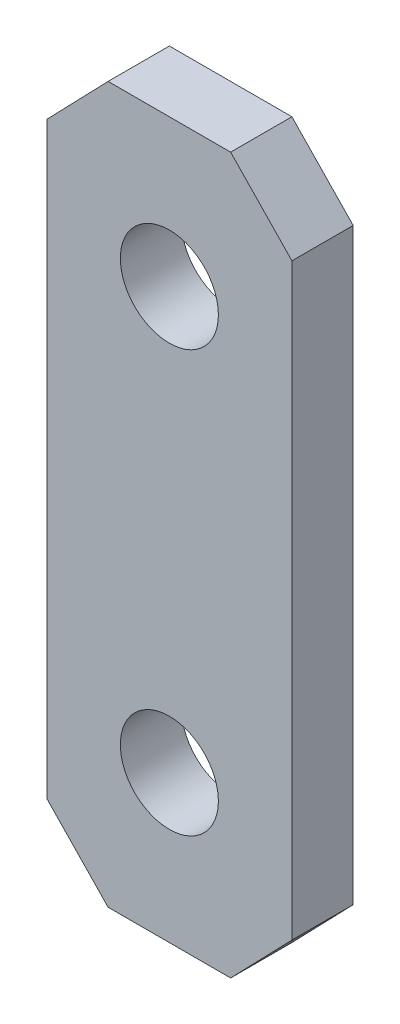
ISO-10303-21;
HEADER;
FILE_DESCRIPTION(('STEP AP214'),'2;1');
FILE_NAME('part.step','',(''),(''),'','','');
FILE_SCHEMA(('AUTOMOTIVE_DESIGN { 1 0 10303 214 1 1 1 1 }'));
ENDSEC;
DATA;
#1=APPLICATION_CONTEXT('core data for automotive mechanical design processes');
#2=APPLICATION_PROTOCOL_DEFINITION('international standard','automotive_design',2000,#1);
#3=PRODUCT_CONTEXT('',#1,'mechanical');
#4=PRODUCT('Part','Part','',(#3));
#5=PRODUCT_RELATED_PRODUCT_CATEGORY('part','',(#4));
#6=PRODUCT_DEFINITION_FORMATION('','',#4);
#7=PRODUCT_DEFINITION_CONTEXT('part definition',#1,'design');
#8=PRODUCT_DEFINITION('design','',#6,#7);
#9=PRODUCT_DEFINITION_SHAPE('','',#8);
#10=(LENGTH_UNIT() NAMED_UNIT(*) SI_UNIT(.MILLI.,.METRE.));
#11=(NAMED_UNIT(*) PLANE_ANGLE_UNIT() SI_UNIT($,.RADIAN.));
#12=(NAMED_UNIT(*) SI_UNIT($,.STERADIAN.) SOLID_ANGLE_UNIT());
#13=UNCERTAINTY_MEASURE_WITH_UNIT(LENGTH_MEASURE(1.E-05),#10,'distance_accuracy_value','');
#14=(GEOMETRIC_REPRESENTATION_CONTEXT(3) GLOBAL_UNCERTAINTY_ASSIGNED_CONTEXT((#13)) GLOBAL_UNIT_ASSIGNED_CONTEXT((#10,
#11,#12)) REPRESENTATION_CONTEXT('',''));
#15=CARTESIAN_POINT('',(0.,0.,0.));
#16=DIRECTION('',(0.,0.,1.));
#17=DIRECTION('',(1.,0.,0.));
#18=AXIS2_PLACEMENT_3D('',#15,#16,#17);
#19=CARTESIAN_POINT('',(0.,0.,3.175));
#20=DIRECTION('',(0.,0.,1.));
#21=DIRECTION('',(1.,0.,0.));
#22=AXIS2_PLACEMENT_3D('',#19,#20,#21);
#23=PLANE('',#22);
#24=DIRECTION('',(0.,-1.,0.));
#25=VECTOR('',#24,1.);
#26=CARTESIAN_POINT('',(0.,15.24,3.175));
#27=LINE('',#26,#25);
#28=CARTESIAN_POINT('',(0.,15.24,3.175));
#29=VERTEX_POINT('',#28);
#30=CARTESIAN_POINT('',(0.,-15.24,3.175));
#31=VERTEX_POINT('',#30);
#32=EDGE_CURVE('E119',#29,#31,#27,.T.);
#33=ORIENTED_EDGE('',*,*,#32,.T.);
#34=DIRECTION('',(-0.694444444444444,0.719546324832701,0.));
#35=VECTOR('',#34,1.);
#36=CARTESIAN_POINT('',(3.175,-18.5297657971351,3.175));
#37=LINE('',#36,#35);
#38=CARTESIAN_POINT('',(3.175,-18.5297657971351,3.175));
#39=VERTEX_POINT('',#38);
#40=EDGE_CURVE('E124',#39,#31,#37,.T.);
#41=ORIENTED_EDGE('',*,*,#40,.F.);
#42=DIRECTION('',(-1.,0.,0.));
#43=VECTOR('',#42,1.);
#44=CARTESIAN_POINT('',(9.525,-18.5297657971351,3.175));
#45=LINE('',#44,#43);
#46=CARTESIAN_POINT('',(9.525,-18.5297657971351,3.175));
#47=VERTEX_POINT('',#46);
#48=EDGE_CURVE('E142',#47,#39,#45,.T.);
#49=ORIENTED_EDGE('',*,*,#48,.F.);
#50=DIRECTION('',(-0.694444444444444,-0.719546324832701,0.));
#51=VECTOR('',#50,1.);
#52=CARTESIAN_POINT('',(12.7,-15.24,3.175));
#53=LINE('',#52,#51);
#54=CARTESIAN_POINT('',(12.7,-15.24,3.175));
#55=VERTEX_POINT('',#54);
#56=EDGE_CURVE('E147',#55,#47,#53,.T.);
#57=ORIENTED_EDGE('',*,*,#56,.F.);
#58=DIRECTION('',(0.,1.,0.));
#59=VECTOR('',#58,1.);
#60=CARTESIAN_POINT('',(12.7,0.,3.175));
#61=LINE('',#60,#59);
#62=CARTESIAN_POINT('',(12.7,15.24,3.175));
#63=VERTEX_POINT('',#62);
#64=EDGE_CURVE('E94',#55,#63,#61,.T.);
#65=ORIENTED_EDGE('',*,*,#64,.T.);
#66=DIRECTION('',(-0.694444444444444,0.719546324832701,0.));
#67=VECTOR('',#66,1.);
#68=CARTESIAN_POINT('',(12.7,15.24,3.175));
#69=LINE('',#68,#67);
#70=CARTESIAN_POINT('',(9.525,18.5297657971351,3.175));
#71=VERTEX_POINT('',#70);
#72=EDGE_CURVE('E184',#63,#71,#69,.T.);
#73=ORIENTED_EDGE('',*,*,#72,.T.);
#74=DIRECTION('',(-1.,0.,0.));
#75=VECTOR('',#74,1.);
#76=CARTESIAN_POINT('',(9.525,18.5297657971351,3.175));
#77=LINE('',#76,#75);
#78=CARTESIAN_POINT('',(3.175,18.5297657971351,3.175));
#79=VERTEX_POINT('',#78);
#80=EDGE_CURVE('E187',#71,#79,#77,.T.);
#81=ORIENTED_EDGE('',*,*,#80,.T.);
#82=DIRECTION('',(-0.694444444444444,-0.719546324832701,0.));
#83=VECTOR('',#82,1.);
#84=CARTESIAN_POINT('',(3.175,18.5297657971351,3.175));
#85=LINE('',#84,#83);
#86=EDGE_CURVE('E63',#79,#29,#85,.T.);
#87=ORIENTED_EDGE('',*,*,#86,.T.);
#88=EDGE_LOOP('',(#33,#41,#49,#57,#65,#73,#81,#87));
#89=FACE_BOUND('',#88,.T.);
#90=CARTESIAN_POINT('',(6.35,10.9097657971351,3.175));
#91=DIRECTION('',(0.,0.,1.));
#92=DIRECTION('',(1.,0.,0.));
#93=AXIS2_PLACEMENT_3D('',#90,#91,#92);
#94=CIRCLE('',#93,2.54);
#95=CARTESIAN_POINT('',(8.89,10.9097657971351,3.175));
#96=VERTEX_POINT('',#95);
#97=EDGE_CURVE('E175',#96,#96,#94,.T.);
#98=ORIENTED_EDGE('',*,*,#97,.F.);
#99=EDGE_LOOP('',(#98));
#100=FACE_BOUND('',#99,.T.);
#101=CARTESIAN_POINT('',(6.35,-10.9097657971351,3.175));
#102=DIRECTION('',(0.,0.,-1.));
#103=DIRECTION('',(1.,0.,0.));
#104=AXIS2_PLACEMENT_3D('',#101,#102,#103);
#105=CIRCLE('',#104,2.54);
#106=CARTESIAN_POINT('',(8.89,-10.9097657971351,3.175));
#107=VERTEX_POINT('',#106);
#108=EDGE_CURVE('E163',#107,#107,#105,.T.);
#109=ORIENTED_EDGE('',*,*,#108,.T.);
#110=EDGE_LOOP('',(#109));
#111=FACE_BOUND('',#110,.T.);
#112=ADVANCED_FACE('F45',(#89,#100,#111),#23,.T.);
#113=CARTESIAN_POINT('',(0.,0.,0.));
#114=DIRECTION('',(0.,0.,1.));
#115=DIRECTION('',(1.,0.,0.));
#116=AXIS2_PLACEMENT_3D('',#113,#114,#115);
#117=PLANE('',#116);
#118=DIRECTION('',(0.,-1.,0.));
#119=VECTOR('',#118,1.);
#120=CARTESIAN_POINT('',(0.,15.24,0.));
#121=LINE('',#120,#119);
#122=CARTESIAN_POINT('',(0.,15.24,0.));
#123=VERTEX_POINT('',#122);
#124=CARTESIAN_POINT('',(0.,-15.24,0.));
#125=VERTEX_POINT('',#124);
#126=EDGE_CURVE('E132',#123,#125,#121,.T.);
#127=ORIENTED_EDGE('',*,*,#126,.F.);
#128=DIRECTION('',(-0.694444444444444,-0.719546324832701,0.));
#129=VECTOR('',#128,1.);
#130=CARTESIAN_POINT('',(3.175,18.5297657971351,0.));
#131=LINE('',#130,#129);
#132=CARTESIAN_POINT('',(3.175,18.5297657971351,0.));
#133=VERTEX_POINT('',#132);
#134=EDGE_CURVE('E87',#133,#123,#131,.T.);
#135=ORIENTED_EDGE('',*,*,#134,.F.);
#136=DIRECTION('',(-1.,0.,0.));
#137=VECTOR('',#136,1.);
#138=CARTESIAN_POINT('',(9.525,18.5297657971351,0.));
#139=LINE('',#138,#137);
#140=CARTESIAN_POINT('',(9.525,18.5297657971351,0.));
#141=VERTEX_POINT('',#140);
#142=EDGE_CURVE('E81',#141,#133,#139,.T.);
#143=ORIENTED_EDGE('',*,*,#142,.F.);
#144=DIRECTION('',(-0.694444444444444,0.719546324832701,0.));
#145=VECTOR('',#144,1.);
#146=CARTESIAN_POINT('',(12.7,15.24,0.));
#147=LINE('',#146,#145);
#148=CARTESIAN_POINT('',(12.7,15.24,0.));
#149=VERTEX_POINT('',#148);
#150=EDGE_CURVE('E198',#149,#141,#147,.T.);
#151=ORIENTED_EDGE('',*,*,#150,.F.);
#152=DIRECTION('',(0.,1.,0.));
#153=VECTOR('',#152,1.);
#154=CARTESIAN_POINT('',(12.7,0.,0.));
#155=LINE('',#154,#153);
#156=CARTESIAN_POINT('',(12.7,-15.24,0.));
#157=VERTEX_POINT('',#156);
#158=EDGE_CURVE('E195',#157,#149,#155,.T.);
#159=ORIENTED_EDGE('',*,*,#158,.F.);
#160=DIRECTION('',(-0.694444444444444,-0.719546324832701,0.));
#161=VECTOR('',#160,1.);
#162=CARTESIAN_POINT('',(12.7,-15.24,0.));
#163=LINE('',#162,#161);
#164=CARTESIAN_POINT('',(9.525,-18.5297657971351,0.));
#165=VERTEX_POINT('',#164);
#166=EDGE_CURVE('E143',#157,#165,#163,.T.);
#167=ORIENTED_EDGE('',*,*,#166,.T.);
#168=DIRECTION('',(-1.,0.,0.));
#169=VECTOR('',#168,1.);
#170=CARTESIAN_POINT('',(9.525,-18.5297657971351,0.));
#171=LINE('',#170,#169);
#172=CARTESIAN_POINT('',(3.175,-18.5297657971351,0.));
#173=VERTEX_POINT('',#172);
#174=EDGE_CURVE('E150',#165,#173,#171,.T.);
#175=ORIENTED_EDGE('',*,*,#174,.T.);
#176=DIRECTION('',(-0.694444444444444,0.719546324832701,0.));
#177=VECTOR('',#176,1.);
#178=CARTESIAN_POINT('',(3.175,-18.5297657971351,0.));
#179=LINE('',#178,#177);
#180=EDGE_CURVE('E160',#173,#125,#179,.T.);
#181=ORIENTED_EDGE('',*,*,#180,.T.);
#182=EDGE_LOOP('',(#127,#135,#143,#151,#159,#167,#175,#181));
#183=FACE_BOUND('',#182,.T.);
#184=CARTESIAN_POINT('',(6.35,10.9097657971351,0.));
#185=DIRECTION('',(0.,0.,1.));
#186=DIRECTION('',(1.,0.,0.));
#187=AXIS2_PLACEMENT_3D('',#184,#185,#186);
#188=CIRCLE('',#187,2.54);
#189=CARTESIAN_POINT('',(8.89,10.9097657971351,0.));
#190=VERTEX_POINT('',#189);
#191=EDGE_CURVE('E137',#190,#190,#188,.T.);
#192=ORIENTED_EDGE('',*,*,#191,.T.);
#193=EDGE_LOOP('',(#192));
#194=FACE_BOUND('',#193,.T.);
#195=CARTESIAN_POINT('',(6.35,-10.9097657971351,0.));
#196=DIRECTION('',(0.,0.,-1.));
#197=DIRECTION('',(1.,0.,0.));
#198=AXIS2_PLACEMENT_3D('',#195,#196,#197);
#199=CIRCLE('',#198,2.54);
#200=CARTESIAN_POINT('',(8.89,-10.9097657971351,0.));
#201=VERTEX_POINT('',#200);
#202=EDGE_CURVE('E153',#201,#201,#199,.T.);
#203=ORIENTED_EDGE('',*,*,#202,.F.);
#204=EDGE_LOOP('',(#203));
#205=FACE_BOUND('',#204,.T.);
#206=ADVANCED_FACE('F217',(#183,#194,#205),#117,.F.);
#207=CARTESIAN_POINT('',(0.,15.24,3.175));
#208=DIRECTION('',(1.,0.,0.));
#209=DIRECTION('',(0.,0.,-1.));
#210=AXIS2_PLACEMENT_3D('',#207,#208,#209);
#211=PLANE('',#210);
#212=ORIENTED_EDGE('',*,*,#126,.T.);
#213=DIRECTION('',(0.,0.,-1.));
#214=VECTOR('',#213,1.);
#215=CARTESIAN_POINT('',(0.,-15.24,3.175));
#216=LINE('',#215,#214);
#217=EDGE_CURVE('E130',#31,#125,#216,.T.);
#218=ORIENTED_EDGE('',*,*,#217,.F.);
#219=ORIENTED_EDGE('',*,*,#32,.F.);
#220=DIRECTION('',(0.,0.,-1.));
#221=VECTOR('',#220,1.);
#222=CARTESIAN_POINT('',(0.,15.24,3.175));
#223=LINE('',#222,#221);
#224=EDGE_CURVE('E192',#29,#123,#223,.T.);
#225=ORIENTED_EDGE('',*,*,#224,.T.);
#226=EDGE_LOOP('',(#212,#218,#219,#225));
#227=FACE_BOUND('',#226,.T.);
#228=ADVANCED_FACE('F47',(#227),#211,.F.);
#229=CARTESIAN_POINT('',(12.7,0.,3.175));
#230=DIRECTION('',(-1.,0.,0.));
#231=DIRECTION('',(0.,0.,1.));
#232=AXIS2_PLACEMENT_3D('',#229,#230,#231);
#233=PLANE('',#232);
#234=ORIENTED_EDGE('',*,*,#158,.T.);
#235=DIRECTION('',(0.,0.,-1.));
#236=VECTOR('',#235,1.);
#237=CARTESIAN_POINT('',(12.7,15.24,3.175));
#238=LINE('',#237,#236);
#239=EDGE_CURVE('E11',#63,#149,#238,.T.);
#240=ORIENTED_EDGE('',*,*,#239,.F.);
#241=ORIENTED_EDGE('',*,*,#64,.F.);
#242=DIRECTION('',(0.,0.,-1.));
#243=VECTOR('',#242,1.);
#244=CARTESIAN_POINT('',(12.7,-15.24,3.175));
#245=LINE('',#244,#243);
#246=EDGE_CURVE('E159',#55,#157,#245,.T.);
#247=ORIENTED_EDGE('',*,*,#246,.T.);
#248=EDGE_LOOP('',(#234,#240,#241,#247));
#249=FACE_BOUND('',#248,.T.);
#250=ADVANCED_FACE('F227',(#249),#233,.F.);
#251=CARTESIAN_POINT('',(12.7,15.24,3.175));
#252=DIRECTION('',(-0.719546324832701,-0.694444444444445,0.));
#253=DIRECTION('',(0.694444444444444,-0.719546324832701,0.));
#254=AXIS2_PLACEMENT_3D('',#251,#252,#253);
#255=PLANE('',#254);
#256=ORIENTED_EDGE('',*,*,#150,.T.);
#257=DIRECTION('',(0.,0.,-1.));
#258=VECTOR('',#257,1.);
#259=CARTESIAN_POINT('',(9.525,18.5297657971351,3.175));
#260=LINE('',#259,#258);
#261=EDGE_CURVE('E55',#71,#141,#260,.T.);
#262=ORIENTED_EDGE('',*,*,#261,.F.);
#263=ORIENTED_EDGE('',*,*,#72,.F.);
#264=ORIENTED_EDGE('',*,*,#239,.T.);
#265=EDGE_LOOP('',(#256,#262,#263,#264));
#266=FACE_BOUND('',#265,.T.);
#267=ADVANCED_FACE('F228',(#266),#255,.F.);
#268=CARTESIAN_POINT('',(9.525,18.5297657971351,3.175));
#269=DIRECTION('',(0.,-1.,0.));
#270=DIRECTION('',(0.,0.,-1.));
#271=AXIS2_PLACEMENT_3D('',#268,#269,#270);
#272=PLANE('',#271);
#273=ORIENTED_EDGE('',*,*,#142,.T.);
#274=DIRECTION('',(0.,0.,-1.));
#275=VECTOR('',#274,1.);
#276=CARTESIAN_POINT('',(3.175,18.5297657971351,3.175));
#277=LINE('',#276,#275);
#278=EDGE_CURVE('E207',#79,#133,#277,.T.);
#279=ORIENTED_EDGE('',*,*,#278,.F.);
#280=ORIENTED_EDGE('',*,*,#80,.F.);
#281=ORIENTED_EDGE('',*,*,#261,.T.);
#282=EDGE_LOOP('',(#273,#279,#280,#281));
#283=FACE_BOUND('',#282,.T.);
#284=ADVANCED_FACE('F212',(#283),#272,.F.);
#285=CARTESIAN_POINT('',(3.175,18.5297657971351,3.175));
#286=DIRECTION('',(0.719546324832701,-0.694444444444445,0.));
#287=DIRECTION('',(0.694444444444444,0.719546324832701,0.));
#288=AXIS2_PLACEMENT_3D('',#285,#286,#287);
#289=PLANE('',#288);
#290=ORIENTED_EDGE('',*,*,#134,.T.);
#291=ORIENTED_EDGE('',*,*,#224,.F.);
#292=ORIENTED_EDGE('',*,*,#86,.F.);
#293=ORIENTED_EDGE('',*,*,#278,.T.);
#294=EDGE_LOOP('',(#290,#291,#292,#293));
#295=FACE_BOUND('',#294,.T.);
#296=ADVANCED_FACE('F229',(#295),#289,.F.);
#297=CARTESIAN_POINT('',(6.35,10.9097657971351,3.175));
#298=DIRECTION('',(0.,0.,-1.));
#299=DIRECTION('',(-1.,0.,0.));
#300=AXIS2_PLACEMENT_3D('',#297,#298,#299);
#301=CYLINDRICAL_SURFACE('',#300,2.54);
#302=ORIENTED_EDGE('',*,*,#97,.T.);
#303=EDGE_LOOP('',(#302));
#304=FACE_BOUND('',#303,.T.);
#305=ORIENTED_EDGE('',*,*,#191,.F.);
#306=EDGE_LOOP('',(#305));
#307=FACE_BOUND('',#306,.T.);
#308=ADVANCED_FACE('F231',(#304,#307),#301,.F.);
#309=CARTESIAN_POINT('',(3.175,-18.5297657971351,3.175));
#310=DIRECTION('',(-0.719546324832701,-0.694444444444445,0.));
#311=DIRECTION('',(0.694444444444444,-0.719546324832701,0.));
#312=AXIS2_PLACEMENT_3D('',#309,#310,#311);
#313=PLANE('',#312);
#314=ORIENTED_EDGE('',*,*,#180,.F.);
#315=DIRECTION('',(0.,0.,-1.));
#316=VECTOR('',#315,1.);
#317=CARTESIAN_POINT('',(3.175,-18.5297657971351,3.175));
#318=LINE('',#317,#316);
#319=EDGE_CURVE('E138',#39,#173,#318,.T.);
#320=ORIENTED_EDGE('',*,*,#319,.F.);
#321=ORIENTED_EDGE('',*,*,#40,.T.);
#322=ORIENTED_EDGE('',*,*,#217,.T.);
#323=EDGE_LOOP('',(#314,#320,#321,#322));
#324=FACE_BOUND('',#323,.T.);
#325=ADVANCED_FACE('F140',(#324),#313,.T.);
#326=CARTESIAN_POINT('',(9.525,-18.5297657971351,3.175));
#327=DIRECTION('',(0.,-1.,0.));
#328=DIRECTION('',(0.,0.,-1.));
#329=AXIS2_PLACEMENT_3D('',#326,#327,#328);
#330=PLANE('',#329);
#331=ORIENTED_EDGE('',*,*,#174,.F.);
#332=DIRECTION('',(0.,0.,-1.));
#333=VECTOR('',#332,1.);
#334=CARTESIAN_POINT('',(9.525,-18.5297657971351,3.175));
#335=LINE('',#334,#333);
#336=EDGE_CURVE('E170',#47,#165,#335,.T.);
#337=ORIENTED_EDGE('',*,*,#336,.F.);
#338=ORIENTED_EDGE('',*,*,#48,.T.);
#339=ORIENTED_EDGE('',*,*,#319,.T.);
#340=EDGE_LOOP('',(#331,#337,#338,#339));
#341=FACE_BOUND('',#340,.T.);
#342=ADVANCED_FACE('F222',(#341),#330,.T.);
#343=CARTESIAN_POINT('',(12.7,-15.24,3.175));
#344=DIRECTION('',(0.719546324832701,-0.694444444444445,0.));
#345=DIRECTION('',(0.694444444444444,0.719546324832701,0.));
#346=AXIS2_PLACEMENT_3D('',#343,#344,#345);
#347=PLANE('',#346);
#348=ORIENTED_EDGE('',*,*,#166,.F.);
#349=ORIENTED_EDGE('',*,*,#246,.F.);
#350=ORIENTED_EDGE('',*,*,#56,.T.);
#351=ORIENTED_EDGE('',*,*,#336,.T.);
#352=EDGE_LOOP('',(#348,#349,#350,#351));
#353=FACE_BOUND('',#352,.T.);
#354=ADVANCED_FACE('F225',(#353),#347,.T.);
#355=CARTESIAN_POINT('',(6.35,-10.9097657971351,3.175));
#356=DIRECTION('',(0.,0.,-1.));
#357=DIRECTION('',(-1.,0.,0.));
#358=AXIS2_PLACEMENT_3D('',#355,#356,#357);
#359=CYLINDRICAL_SURFACE('',#358,2.54);
#360=ORIENTED_EDGE('',*,*,#108,.F.);
#361=EDGE_LOOP('',(#360));
#362=FACE_BOUND('',#361,.T.);
#363=ORIENTED_EDGE('',*,*,#202,.T.);
#364=EDGE_LOOP('',(#363));
#365=FACE_BOUND('',#364,.T.);
#366=ADVANCED_FACE('F253',(#362,#365),#359,.F.);
#367=CLOSED_SHELL('',(#112,#206,#228,#250,#267,#284,#296,#308,#325,#342,#354,#366));
#368=MANIFOLD_SOLID_BREP('B2',#367);
#369=ADVANCED_BREP_SHAPE_REPRESENTATION('',(#18,#368),#14);
#370=SHAPE_DEFINITION_REPRESENTATION(#9,#369);
ENDSEC;
END-ISO-10303-21;
